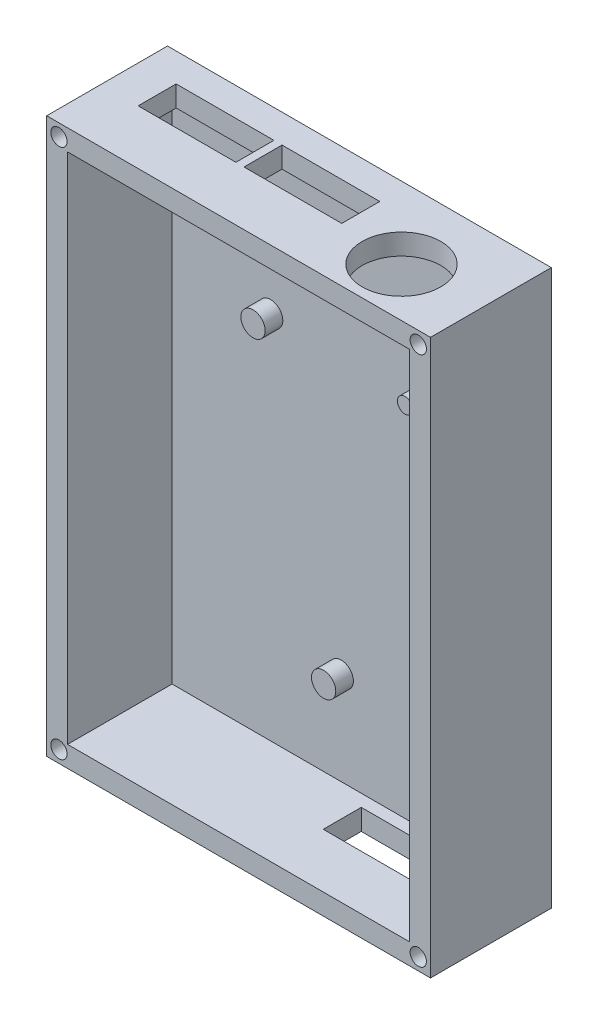
ISO-10303-21;
HEADER;
FILE_DESCRIPTION(('STEP AP214'),'2;1');
FILE_NAME('part.step','',(''),(''),'','','');
FILE_SCHEMA(('AUTOMOTIVE_DESIGN { 1 0 10303 214 1 1 1 1 }'));
ENDSEC;
DATA;
#1=APPLICATION_CONTEXT('core data for automotive mechanical design processes');
#2=APPLICATION_PROTOCOL_DEFINITION('international standard','automotive_design',2000,#1);
#3=PRODUCT_CONTEXT('',#1,'mechanical');
#4=PRODUCT('Part','Part','',(#3));
#5=PRODUCT_RELATED_PRODUCT_CATEGORY('part','',(#4));
#6=PRODUCT_DEFINITION_FORMATION('','',#4);
#7=PRODUCT_DEFINITION_CONTEXT('part definition',#1,'design');
#8=PRODUCT_DEFINITION('design','',#6,#7);
#9=PRODUCT_DEFINITION_SHAPE('','',#8);
#10=(LENGTH_UNIT() NAMED_UNIT(*) SI_UNIT(.MILLI.,.METRE.));
#11=(NAMED_UNIT(*) PLANE_ANGLE_UNIT() SI_UNIT($,.RADIAN.));
#12=(NAMED_UNIT(*) SI_UNIT($,.STERADIAN.) SOLID_ANGLE_UNIT());
#13=UNCERTAINTY_MEASURE_WITH_UNIT(LENGTH_MEASURE(1.E-05),#10,'distance_accuracy_value','');
#14=(GEOMETRIC_REPRESENTATION_CONTEXT(3) GLOBAL_UNCERTAINTY_ASSIGNED_CONTEXT((#13)) GLOBAL_UNIT_ASSIGNED_CONTEXT((#10,
#11,#12)) REPRESENTATION_CONTEXT('',''));
#15=CARTESIAN_POINT('',(0.,0.,0.));
#16=DIRECTION('',(0.,0.,1.));
#17=DIRECTION('',(1.,0.,0.));
#18=AXIS2_PLACEMENT_3D('',#15,#16,#17);
#19=CARTESIAN_POINT('',(0.,0.,0.));
#20=DIRECTION('',(0.,0.,1.));
#21=DIRECTION('',(1.,0.,0.));
#22=AXIS2_PLACEMENT_3D('',#19,#20,#21);
#23=PLANE('',#22);
#24=DIRECTION('',(1.,0.,0.));
#25=VECTOR('',#24,1.);
#26=CARTESIAN_POINT('',(0.,3.84099025766973,0.));
#27=LINE('',#26,#25);
#28=CARTESIAN_POINT('',(3.84099025766973,3.84099025766973,0.));
#29=VERTEX_POINT('',#28);
#30=CARTESIAN_POINT('',(66.8409902576697,3.84099025766973,0.));
#31=VERTEX_POINT('',#30);
#32=EDGE_CURVE('E273',#29,#31,#27,.T.);
#33=ORIENTED_EDGE('',*,*,#32,.T.);
#34=DIRECTION('',(0.,1.,0.));
#35=VECTOR('',#34,1.);
#36=CARTESIAN_POINT('',(66.8409902576697,0.,0.));
#37=LINE('',#36,#35);
#38=CARTESIAN_POINT('',(66.8409902576697,98.3409902576697,0.));
#39=VERTEX_POINT('',#38);
#40=EDGE_CURVE('E317',#31,#39,#37,.T.);
#41=ORIENTED_EDGE('',*,*,#40,.T.);
#42=DIRECTION('',(1.,0.,0.));
#43=VECTOR('',#42,1.);
#44=CARTESIAN_POINT('',(0.,98.3409902576697,0.));
#45=LINE('',#44,#43);
#46=CARTESIAN_POINT('',(3.84099025766974,98.3409902576697,0.));
#47=VERTEX_POINT('',#46);
#48=EDGE_CURVE('E314',#47,#39,#45,.T.);
#49=ORIENTED_EDGE('',*,*,#48,.F.);
#50=DIRECTION('',(0.,1.,0.));
#51=VECTOR('',#50,1.);
#52=CARTESIAN_POINT('',(3.84099025766973,0.,0.));
#53=LINE('',#52,#51);
#54=EDGE_CURVE('E311',#29,#47,#53,.T.);
#55=ORIENTED_EDGE('',*,*,#54,.F.);
#56=EDGE_LOOP('',(#33,#41,#49,#55));
#57=FACE_BOUND('',#56,.T.);
#58=CARTESIAN_POINT('',(50.,73.,0.));
#59=DIRECTION('',(0.,0.,1.));
#60=DIRECTION('',(1.,0.,0.));
#61=AXIS2_PLACEMENT_3D('',#58,#59,#60);
#62=CIRCLE('',#61,1.41421356237309);
#63=CARTESIAN_POINT('',(51.4142135623731,73.,0.));
#64=VERTEX_POINT('',#63);
#65=EDGE_CURVE('E339',#64,#64,#62,.T.);
#66=ORIENTED_EDGE('',*,*,#65,.F.);
#67=EDGE_LOOP('',(#66));
#68=FACE_BOUND('',#67,.T.);
#69=CARTESIAN_POINT('',(22.,72.,0.));
#70=DIRECTION('',(0.,0.,1.));
#71=DIRECTION('',(1.,0.,0.));
#72=AXIS2_PLACEMENT_3D('',#69,#70,#71);
#73=CIRCLE('',#72,2.23606797749979);
#74=CARTESIAN_POINT('',(24.2360679774998,72.,0.));
#75=VERTEX_POINT('',#74);
#76=EDGE_CURVE('E360',#75,#75,#73,.T.);
#77=ORIENTED_EDGE('',*,*,#76,.F.);
#78=EDGE_LOOP('',(#77));
#79=FACE_BOUND('',#78,.T.);
#80=CARTESIAN_POINT('',(35.,21.,0.));
#81=DIRECTION('',(0.,0.,1.));
#82=DIRECTION('',(1.,0.,0.));
#83=AXIS2_PLACEMENT_3D('',#80,#81,#82);
#84=CIRCLE('',#83,2.23606797749979);
#85=CARTESIAN_POINT('',(37.2360679774998,21.,0.));
#86=VERTEX_POINT('',#85);
#87=EDGE_CURVE('E335',#86,#86,#84,.T.);
#88=ORIENTED_EDGE('',*,*,#87,.F.);
#89=EDGE_LOOP('',(#88));
#90=FACE_BOUND('',#89,.T.);
#91=ADVANCED_FACE('F35',(#57,#68,#79,#90),#23,.T.);
#92=CARTESIAN_POINT('',(22.,72.,3.25));
#93=DIRECTION('',(0.,0.,-1.));
#94=DIRECTION('',(-1.,0.,0.));
#95=AXIS2_PLACEMENT_3D('',#92,#93,#94);
#96=CYLINDRICAL_SURFACE('',#95,2.23606797749979);
#97=CARTESIAN_POINT('',(22.,72.,3.25));
#98=DIRECTION('',(0.,0.,1.));
#99=DIRECTION('',(1.,0.,0.));
#100=AXIS2_PLACEMENT_3D('',#97,#98,#99);
#101=CIRCLE('',#100,2.23606797749979);
#102=CARTESIAN_POINT('',(24.2360679774998,72.,3.25));
#103=VERTEX_POINT('',#102);
#104=EDGE_CURVE('E368',#103,#103,#101,.T.);
#105=ORIENTED_EDGE('',*,*,#104,.F.);
#106=EDGE_LOOP('',(#105));
#107=FACE_BOUND('',#106,.T.);
#108=ORIENTED_EDGE('',*,*,#76,.T.);
#109=EDGE_LOOP('',(#108));
#110=FACE_BOUND('',#109,.T.);
#111=ADVANCED_FACE('F37',(#107,#110),#96,.T.);
#112=CARTESIAN_POINT('',(0.,0.,3.25));
#113=DIRECTION('',(0.,0.,1.));
#114=DIRECTION('',(1.,0.,0.));
#115=AXIS2_PLACEMENT_3D('',#112,#113,#114);
#116=PLANE('',#115);
#117=ORIENTED_EDGE('',*,*,#104,.T.);
#118=EDGE_LOOP('',(#117));
#119=FACE_BOUND('',#118,.T.);
#120=ADVANCED_FACE('F398',(#119),#116,.T.);
#121=CARTESIAN_POINT('',(50.,73.,3.25));
#122=DIRECTION('',(0.,0.,-1.));
#123=DIRECTION('',(-1.,0.,0.));
#124=AXIS2_PLACEMENT_3D('',#121,#122,#123);
#125=CYLINDRICAL_SURFACE('',#124,1.41421356237309);
#126=CARTESIAN_POINT('',(50.,73.,3.25));
#127=DIRECTION('',(0.,0.,1.));
#128=DIRECTION('',(1.,0.,0.));
#129=AXIS2_PLACEMENT_3D('',#126,#127,#128);
#130=CIRCLE('',#129,1.41421356237309);
#131=CARTESIAN_POINT('',(51.4142135623731,73.,3.25));
#132=VERTEX_POINT('',#131);
#133=EDGE_CURVE('E342',#132,#132,#130,.T.);
#134=ORIENTED_EDGE('',*,*,#133,.F.);
#135=EDGE_LOOP('',(#134));
#136=FACE_BOUND('',#135,.T.);
#137=ORIENTED_EDGE('',*,*,#65,.T.);
#138=EDGE_LOOP('',(#137));
#139=FACE_BOUND('',#138,.T.);
#140=ADVANCED_FACE('F420',(#136,#139),#125,.T.);
#141=CARTESIAN_POINT('',(0.,0.,3.25));
#142=DIRECTION('',(0.,0.,1.));
#143=DIRECTION('',(1.,0.,0.));
#144=AXIS2_PLACEMENT_3D('',#141,#142,#143);
#145=PLANE('',#144);
#146=ORIENTED_EDGE('',*,*,#133,.T.);
#147=EDGE_LOOP('',(#146));
#148=FACE_BOUND('',#147,.T.);
#149=ADVANCED_FACE('F411',(#148),#145,.T.);
#150=CARTESIAN_POINT('',(35.,21.,3.25));
#151=DIRECTION('',(0.,0.,-1.));
#152=DIRECTION('',(-1.,0.,0.));
#153=AXIS2_PLACEMENT_3D('',#150,#151,#152);
#154=CYLINDRICAL_SURFACE('',#153,2.23606797749979);
#155=CARTESIAN_POINT('',(35.,21.,3.25));
#156=DIRECTION('',(0.,0.,1.));
#157=DIRECTION('',(1.,0.,0.));
#158=AXIS2_PLACEMENT_3D('',#155,#156,#157);
#159=CIRCLE('',#158,2.23606797749979);
#160=CARTESIAN_POINT('',(37.2360679774998,21.,3.25));
#161=VERTEX_POINT('',#160);
#162=EDGE_CURVE('E336',#161,#161,#159,.T.);
#163=ORIENTED_EDGE('',*,*,#162,.F.);
#164=EDGE_LOOP('',(#163));
#165=FACE_BOUND('',#164,.T.);
#166=ORIENTED_EDGE('',*,*,#87,.T.);
#167=EDGE_LOOP('',(#166));
#168=FACE_BOUND('',#167,.T.);
#169=ADVANCED_FACE('F408',(#165,#168),#154,.T.);
#170=CARTESIAN_POINT('',(0.,0.,3.25));
#171=DIRECTION('',(0.,0.,1.));
#172=DIRECTION('',(1.,0.,0.));
#173=AXIS2_PLACEMENT_3D('',#170,#171,#172);
#174=PLANE('',#173);
#175=ORIENTED_EDGE('',*,*,#162,.T.);
#176=EDGE_LOOP('',(#175));
#177=FACE_BOUND('',#176,.T.);
#178=ADVANCED_FACE('F410',(#177),#174,.T.);
#179=CARTESIAN_POINT('',(0.,3.84099025766973,19.25));
#180=DIRECTION('',(0.,1.,0.));
#181=DIRECTION('',(-1.,0.,0.));
#182=AXIS2_PLACEMENT_3D('',#179,#180,#181);
#183=PLANE('',#182);
#184=DIRECTION('',(1.,0.,0.));
#185=VECTOR('',#184,1.);
#186=CARTESIAN_POINT('',(40.9319805153395,3.84099025766973,2.25));
#187=LINE('',#186,#185);
#188=CARTESIAN_POINT('',(40.9319805153395,3.84099025766973,2.25));
#189=VERTEX_POINT('',#188);
#190=CARTESIAN_POINT('',(58.9319805153395,3.84099025766974,2.25));
#191=VERTEX_POINT('',#190);
#192=EDGE_CURVE('E186',#189,#191,#187,.T.);
#193=ORIENTED_EDGE('',*,*,#192,.T.);
#194=DIRECTION('',(0.,0.,1.));
#195=VECTOR('',#194,1.);
#196=CARTESIAN_POINT('',(58.9319805153395,3.84099025766973,2.25));
#197=LINE('',#196,#195);
#198=CARTESIAN_POINT('',(58.9319805153395,3.84099025766973,9.25));
#199=VERTEX_POINT('',#198);
#200=EDGE_CURVE('E173',#191,#199,#197,.T.);
#201=ORIENTED_EDGE('',*,*,#200,.T.);
#202=DIRECTION('',(-1.,0.,0.));
#203=VECTOR('',#202,1.);
#204=CARTESIAN_POINT('',(40.9319805153395,3.84099025766973,9.25));
#205=LINE('',#204,#203);
#206=CARTESIAN_POINT('',(40.9319805153395,3.84099025766973,9.25));
#207=VERTEX_POINT('',#206);
#208=EDGE_CURVE('E204',#199,#207,#205,.T.);
#209=ORIENTED_EDGE('',*,*,#208,.T.);
#210=DIRECTION('',(0.,0.,-1.));
#211=VECTOR('',#210,1.);
#212=CARTESIAN_POINT('',(40.9319805153395,3.84099025766973,2.25));
#213=LINE('',#212,#211);
#214=EDGE_CURVE('E194',#207,#189,#213,.T.);
#215=ORIENTED_EDGE('',*,*,#214,.T.);
#216=EDGE_LOOP('',(#193,#201,#209,#215));
#217=FACE_BOUND('',#216,.T.);
#218=ORIENTED_EDGE('',*,*,#32,.F.);
#219=DIRECTION('',(0.,0.,-1.));
#220=VECTOR('',#219,1.);
#221=CARTESIAN_POINT('',(3.84099025766973,3.84099025766973,19.25));
#222=LINE('',#221,#220);
#223=CARTESIAN_POINT('',(3.84099025766973,3.84099025766973,19.25));
#224=VERTEX_POINT('',#223);
#225=EDGE_CURVE('E332',#224,#29,#222,.T.);
#226=ORIENTED_EDGE('',*,*,#225,.F.);
#227=DIRECTION('',(1.,0.,0.));
#228=VECTOR('',#227,1.);
#229=CARTESIAN_POINT('',(0.,3.84099025766973,19.25));
#230=LINE('',#229,#228);
#231=CARTESIAN_POINT('',(66.8409902576697,3.84099025766973,19.25));
#232=VERTEX_POINT('',#231);
#233=EDGE_CURVE('E274',#224,#232,#230,.T.);
#234=ORIENTED_EDGE('',*,*,#233,.T.);
#235=DIRECTION('',(0.,0.,-1.));
#236=VECTOR('',#235,1.);
#237=CARTESIAN_POINT('',(66.8409902576697,3.84099025766973,19.25));
#238=LINE('',#237,#236);
#239=EDGE_CURVE('E309',#232,#31,#238,.T.);
#240=ORIENTED_EDGE('',*,*,#239,.T.);
#241=EDGE_LOOP('',(#218,#226,#234,#240));
#242=FACE_BOUND('',#241,.T.);
#243=ADVANCED_FACE('F192',(#217,#242),#183,.T.);
#244=CARTESIAN_POINT('',(3.84099025766973,0.,19.25));
#245=DIRECTION('',(-1.,0.,0.));
#246=DIRECTION('',(0.,-1.,0.));
#247=AXIS2_PLACEMENT_3D('',#244,#245,#246);
#248=PLANE('',#247);
#249=ORIENTED_EDGE('',*,*,#54,.T.);
#250=DIRECTION('',(0.,0.,-1.));
#251=VECTOR('',#250,1.);
#252=CARTESIAN_POINT('',(3.84099025766974,98.3409902576697,19.25));
#253=LINE('',#252,#251);
#254=CARTESIAN_POINT('',(3.84099025766974,98.3409902576697,19.25));
#255=VERTEX_POINT('',#254);
#256=EDGE_CURVE('E329',#255,#47,#253,.T.);
#257=ORIENTED_EDGE('',*,*,#256,.F.);
#258=DIRECTION('',(0.,1.,0.));
#259=VECTOR('',#258,1.);
#260=CARTESIAN_POINT('',(3.84099025766973,0.,19.25));
#261=LINE('',#260,#259);
#262=EDGE_CURVE('E277',#224,#255,#261,.T.);
#263=ORIENTED_EDGE('',*,*,#262,.F.);
#264=ORIENTED_EDGE('',*,*,#225,.T.);
#265=EDGE_LOOP('',(#249,#257,#263,#264));
#266=FACE_BOUND('',#265,.T.);
#267=ADVANCED_FACE('F487',(#266),#248,.F.);
#268=CARTESIAN_POINT('',(0.,98.3409902576697,19.25));
#269=DIRECTION('',(0.,1.,0.));
#270=DIRECTION('',(-1.,0.,0.));
#271=AXIS2_PLACEMENT_3D('',#268,#269,#270);
#272=PLANE('',#271);
#273=DIRECTION('',(1.,0.,0.));
#274=VECTOR('',#273,1.);
#275=CARTESIAN_POINT('',(26.3409902576697,98.3409902576697,2.25));
#276=LINE('',#275,#274);
#277=CARTESIAN_POINT('',(26.3409902576697,98.3409902576697,2.25));
#278=VERTEX_POINT('',#277);
#279=CARTESIAN_POINT('',(44.3409902576697,98.3409902576697,2.25));
#280=VERTEX_POINT('',#279);
#281=EDGE_CURVE('E220',#278,#280,#276,.T.);
#282=ORIENTED_EDGE('',*,*,#281,.F.);
#283=DIRECTION('',(0.,0.,-1.));
#284=VECTOR('',#283,1.);
#285=CARTESIAN_POINT('',(26.3409902576697,98.3409902576697,2.25));
#286=LINE('',#285,#284);
#287=CARTESIAN_POINT('',(26.3409902576697,98.3409902576697,9.25));
#288=VERTEX_POINT('',#287);
#289=EDGE_CURVE('E209',#288,#278,#286,.T.);
#290=ORIENTED_EDGE('',*,*,#289,.F.);
#291=DIRECTION('',(-1.,0.,0.));
#292=VECTOR('',#291,1.);
#293=CARTESIAN_POINT('',(26.3409902576697,98.3409902576697,9.25));
#294=LINE('',#293,#292);
#295=CARTESIAN_POINT('',(44.3409902576697,98.3409902576697,9.25));
#296=VERTEX_POINT('',#295);
#297=EDGE_CURVE('E226',#296,#288,#294,.T.);
#298=ORIENTED_EDGE('',*,*,#297,.F.);
#299=DIRECTION('',(0.,0.,1.));
#300=VECTOR('',#299,1.);
#301=CARTESIAN_POINT('',(44.3409902576697,98.3409902576697,2.25));
#302=LINE('',#301,#300);
#303=EDGE_CURVE('E223',#280,#296,#302,.T.);
#304=ORIENTED_EDGE('',*,*,#303,.F.);
#305=EDGE_LOOP('',(#282,#290,#298,#304));
#306=FACE_BOUND('',#305,.T.);
#307=DIRECTION('',(1.,0.,0.));
#308=VECTOR('',#307,1.);
#309=CARTESIAN_POINT('',(6.84099025766974,98.3409902576697,2.25));
#310=LINE('',#309,#308);
#311=CARTESIAN_POINT('',(6.84099025766974,98.3409902576697,2.25));
#312=VERTEX_POINT('',#311);
#313=CARTESIAN_POINT('',(24.8409902576697,98.3409902576697,2.25));
#314=VERTEX_POINT('',#313);
#315=EDGE_CURVE('E249',#312,#314,#310,.T.);
#316=ORIENTED_EDGE('',*,*,#315,.F.);
#317=DIRECTION('',(0.,0.,-1.));
#318=VECTOR('',#317,1.);
#319=CARTESIAN_POINT('',(6.84099025766974,98.3409902576697,2.25));
#320=LINE('',#319,#318);
#321=CARTESIAN_POINT('',(6.84099025766974,98.3409902576697,9.25));
#322=VERTEX_POINT('',#321);
#323=EDGE_CURVE('E238',#322,#312,#320,.T.);
#324=ORIENTED_EDGE('',*,*,#323,.F.);
#325=DIRECTION('',(-1.,0.,0.));
#326=VECTOR('',#325,1.);
#327=CARTESIAN_POINT('',(6.84099025766974,98.3409902576697,9.25));
#328=LINE('',#327,#326);
#329=CARTESIAN_POINT('',(24.8409902576697,98.3409902576697,9.25));
#330=VERTEX_POINT('',#329);
#331=EDGE_CURVE('E255',#330,#322,#328,.T.);
#332=ORIENTED_EDGE('',*,*,#331,.F.);
#333=DIRECTION('',(0.,0.,1.));
#334=VECTOR('',#333,1.);
#335=CARTESIAN_POINT('',(24.8409902576697,98.3409902576697,2.25));
#336=LINE('',#335,#334);
#337=EDGE_CURVE('E252',#314,#330,#336,.T.);
#338=ORIENTED_EDGE('',*,*,#337,.F.);
#339=EDGE_LOOP('',(#316,#324,#332,#338));
#340=FACE_BOUND('',#339,.T.);
#341=CARTESIAN_POINT('',(56.3409902576698,98.3409902576697,10.25));
#342=DIRECTION('',(0.,-1.,0.));
#343=DIRECTION('',(0.,0.,-1.));
#344=AXIS2_PLACEMENT_3D('',#341,#342,#343);
#345=CIRCLE('',#344,7.25);
#346=CARTESIAN_POINT('',(56.3409902576698,98.3409902576697,3.));
#347=VERTEX_POINT('',#346);
#348=EDGE_CURVE('E267',#347,#347,#345,.T.);
#349=ORIENTED_EDGE('',*,*,#348,.F.);
#350=EDGE_LOOP('',(#349));
#351=FACE_BOUND('',#350,.T.);
#352=ORIENTED_EDGE('',*,*,#48,.T.);
#353=DIRECTION('',(0.,0.,-1.));
#354=VECTOR('',#353,1.);
#355=CARTESIAN_POINT('',(66.8409902576697,98.3409902576697,19.25));
#356=LINE('',#355,#354);
#357=CARTESIAN_POINT('',(66.8409902576697,98.3409902576697,19.25));
#358=VERTEX_POINT('',#357);
#359=EDGE_CURVE('E326',#358,#39,#356,.T.);
#360=ORIENTED_EDGE('',*,*,#359,.F.);
#361=DIRECTION('',(1.,0.,0.));
#362=VECTOR('',#361,1.);
#363=CARTESIAN_POINT('',(0.,98.3409902576697,19.25));
#364=LINE('',#363,#362);
#365=EDGE_CURVE('E280',#255,#358,#364,.T.);
#366=ORIENTED_EDGE('',*,*,#365,.F.);
#367=ORIENTED_EDGE('',*,*,#256,.T.);
#368=EDGE_LOOP('',(#352,#360,#366,#367));
#369=FACE_BOUND('',#368,.T.);
#370=ADVANCED_FACE('F477',(#306,#340,#351,#369),#272,.F.);
#371=CARTESIAN_POINT('',(2.25,2.25,19.25));
#372=DIRECTION('',(0.,0.,-1.));
#373=DIRECTION('',(-1.,0.,0.));
#374=AXIS2_PLACEMENT_3D('',#371,#372,#373);
#375=CYLINDRICAL_SURFACE('',#374,1.5);
#376=CARTESIAN_POINT('',(2.25,2.25,19.25));
#377=DIRECTION('',(0.,0.,1.));
#378=DIRECTION('',(1.,0.,0.));
#379=AXIS2_PLACEMENT_3D('',#376,#377,#378);
#380=CIRCLE('',#379,1.5);
#381=CARTESIAN_POINT('',(3.75,2.25,19.25));
#382=VERTEX_POINT('',#381);
#383=EDGE_CURVE('E291',#382,#382,#380,.T.);
#384=ORIENTED_EDGE('',*,*,#383,.T.);
#385=EDGE_LOOP('',(#384));
#386=FACE_BOUND('',#385,.T.);
#387=CARTESIAN_POINT('',(2.25,2.25,0.));
#388=DIRECTION('',(0.,0.,1.));
#389=DIRECTION('',(1.,0.,0.));
#390=AXIS2_PLACEMENT_3D('',#387,#388,#389);
#391=CIRCLE('',#390,1.5);
#392=CARTESIAN_POINT('',(3.75,2.25,0.));
#393=VERTEX_POINT('',#392);
#394=EDGE_CURVE('E11',#393,#393,#391,.F.);
#395=ORIENTED_EDGE('',*,*,#394,.T.);
#396=EDGE_LOOP('',(#395));
#397=FACE_BOUND('',#396,.T.);
#398=ADVANCED_FACE('F473',(#386,#397),#375,.F.);
#399=CARTESIAN_POINT('',(68.4319805153395,2.25,19.25));
#400=DIRECTION('',(0.,0.,-1.));
#401=DIRECTION('',(-1.,0.,0.));
#402=AXIS2_PLACEMENT_3D('',#399,#400,#401);
#403=CYLINDRICAL_SURFACE('',#402,1.5);
#404=CARTESIAN_POINT('',(68.4319805153395,2.25,19.25));
#405=DIRECTION('',(0.,0.,1.));
#406=DIRECTION('',(1.,0.,0.));
#407=AXIS2_PLACEMENT_3D('',#404,#405,#406);
#408=CIRCLE('',#407,1.5);
#409=CARTESIAN_POINT('',(69.9319805153395,2.25,19.25));
#410=VERTEX_POINT('',#409);
#411=EDGE_CURVE('E288',#410,#410,#408,.F.);
#412=ORIENTED_EDGE('',*,*,#411,.F.);
#413=EDGE_LOOP('',(#412));
#414=FACE_BOUND('',#413,.T.);
#415=CARTESIAN_POINT('',(68.4319805153395,2.25,0.));
#416=DIRECTION('',(0.,0.,1.));
#417=DIRECTION('',(1.,0.,0.));
#418=AXIS2_PLACEMENT_3D('',#415,#416,#417);
#419=CIRCLE('',#418,1.5);
#420=CARTESIAN_POINT('',(69.9319805153395,2.25,0.));
#421=VERTEX_POINT('',#420);
#422=EDGE_CURVE('E319',#421,#421,#419,.F.);
#423=ORIENTED_EDGE('',*,*,#422,.T.);
#424=EDGE_LOOP('',(#423));
#425=FACE_BOUND('',#424,.T.);
#426=ADVANCED_FACE('F476',(#414,#425),#403,.F.);
#427=CARTESIAN_POINT('',(68.4319805153395,99.9319805153395,19.25));
#428=DIRECTION('',(0.,0.,-1.));
#429=DIRECTION('',(-1.,0.,0.));
#430=AXIS2_PLACEMENT_3D('',#427,#428,#429);
#431=CYLINDRICAL_SURFACE('',#430,1.5);
#432=CARTESIAN_POINT('',(68.4319805153395,99.9319805153395,19.25));
#433=DIRECTION('',(0.,0.,1.));
#434=DIRECTION('',(1.,0.,0.));
#435=AXIS2_PLACEMENT_3D('',#432,#433,#434);
#436=CIRCLE('',#435,1.5);
#437=CARTESIAN_POINT('',(69.9319805153395,99.9319805153395,19.25));
#438=VERTEX_POINT('',#437);
#439=EDGE_CURVE('E285',#438,#438,#436,.T.);
#440=ORIENTED_EDGE('',*,*,#439,.T.);
#441=EDGE_LOOP('',(#440));
#442=FACE_BOUND('',#441,.T.);
#443=CARTESIAN_POINT('',(68.4319805153395,99.9319805153395,0.));
#444=DIRECTION('',(0.,0.,1.));
#445=DIRECTION('',(1.,0.,0.));
#446=AXIS2_PLACEMENT_3D('',#443,#444,#445);
#447=CIRCLE('',#446,1.5);
#448=CARTESIAN_POINT('',(69.9319805153395,99.9319805153395,0.));
#449=VERTEX_POINT('',#448);
#450=EDGE_CURVE('E43',#449,#449,#447,.F.);
#451=ORIENTED_EDGE('',*,*,#450,.T.);
#452=EDGE_LOOP('',(#451));
#453=FACE_BOUND('',#452,.T.);
#454=ADVANCED_FACE('F373',(#442,#453),#431,.F.);
#455=CARTESIAN_POINT('',(66.8409902576697,0.,19.25));
#456=DIRECTION('',(-1.,0.,0.));
#457=DIRECTION('',(0.,-1.,0.));
#458=AXIS2_PLACEMENT_3D('',#455,#456,#457);
#459=PLANE('',#458);
#460=ORIENTED_EDGE('',*,*,#40,.F.);
#461=ORIENTED_EDGE('',*,*,#239,.F.);
#462=DIRECTION('',(0.,1.,0.));
#463=VECTOR('',#462,1.);
#464=CARTESIAN_POINT('',(66.8409902576697,0.,19.25));
#465=LINE('',#464,#463);
#466=EDGE_CURVE('E282',#232,#358,#465,.T.);
#467=ORIENTED_EDGE('',*,*,#466,.T.);
#468=ORIENTED_EDGE('',*,*,#359,.T.);
#469=EDGE_LOOP('',(#460,#461,#467,#468));
#470=FACE_BOUND('',#469,.T.);
#471=ADVANCED_FACE('F463',(#470),#459,.T.);
#472=CARTESIAN_POINT('',(2.25,99.9319805153395,19.25));
#473=DIRECTION('',(0.,0.,-1.));
#474=DIRECTION('',(-1.,0.,0.));
#475=AXIS2_PLACEMENT_3D('',#472,#473,#474);
#476=CYLINDRICAL_SURFACE('',#475,1.5);
#477=CARTESIAN_POINT('',(2.25,99.9319805153395,19.25));
#478=DIRECTION('',(0.,0.,1.));
#479=DIRECTION('',(1.,0.,0.));
#480=AXIS2_PLACEMENT_3D('',#477,#478,#479);
#481=CIRCLE('',#480,1.5);
#482=CARTESIAN_POINT('',(3.75,99.9319805153395,19.25));
#483=VERTEX_POINT('',#482);
#484=EDGE_CURVE('E306',#483,#483,#481,.F.);
#485=ORIENTED_EDGE('',*,*,#484,.F.);
#486=EDGE_LOOP('',(#485));
#487=FACE_BOUND('',#486,.T.);
#488=CARTESIAN_POINT('',(2.25,99.9319805153395,0.));
#489=DIRECTION('',(0.,0.,1.));
#490=DIRECTION('',(1.,0.,0.));
#491=AXIS2_PLACEMENT_3D('',#488,#489,#490);
#492=CIRCLE('',#491,1.5);
#493=CARTESIAN_POINT('',(3.75,99.9319805153395,0.));
#494=VERTEX_POINT('',#493);
#495=EDGE_CURVE('E278',#494,#494,#492,.F.);
#496=ORIENTED_EDGE('',*,*,#495,.T.);
#497=EDGE_LOOP('',(#496));
#498=FACE_BOUND('',#497,.T.);
#499=ADVANCED_FACE('F440',(#487,#498),#476,.F.);
#500=CARTESIAN_POINT('',(0.,0.,19.25));
#501=DIRECTION('',(0.,0.,1.));
#502=DIRECTION('',(1.,0.,0.));
#503=AXIS2_PLACEMENT_3D('',#500,#501,#502);
#504=PLANE('',#503);
#505=ORIENTED_EDGE('',*,*,#233,.F.);
#506=ORIENTED_EDGE('',*,*,#262,.T.);
#507=ORIENTED_EDGE('',*,*,#365,.T.);
#508=ORIENTED_EDGE('',*,*,#466,.F.);
#509=EDGE_LOOP('',(#505,#506,#507,#508));
#510=FACE_BOUND('',#509,.T.);
#511=ORIENTED_EDGE('',*,*,#439,.F.);
#512=EDGE_LOOP('',(#511));
#513=FACE_BOUND('',#512,.T.);
#514=ORIENTED_EDGE('',*,*,#411,.T.);
#515=EDGE_LOOP('',(#514));
#516=FACE_BOUND('',#515,.T.);
#517=ORIENTED_EDGE('',*,*,#383,.F.);
#518=EDGE_LOOP('',(#517));
#519=FACE_BOUND('',#518,.T.);
#520=DIRECTION('',(1.,0.,0.));
#521=VECTOR('',#520,1.);
#522=CARTESIAN_POINT('',(0.,0.,19.25));
#523=LINE('',#522,#521);
#524=CARTESIAN_POINT('',(0.,0.,19.25));
#525=VERTEX_POINT('',#524);
#526=CARTESIAN_POINT('',(70.6819805153395,0.,19.25));
#527=VERTEX_POINT('',#526);
#528=EDGE_CURVE('E294',#525,#527,#523,.T.);
#529=ORIENTED_EDGE('',*,*,#528,.T.);
#530=DIRECTION('',(0.,1.,0.));
#531=VECTOR('',#530,1.);
#532=CARTESIAN_POINT('',(70.6819805153395,0.,19.25));
#533=LINE('',#532,#531);
#534=CARTESIAN_POINT('',(70.6819805153395,102.181980515339,19.25));
#535=VERTEX_POINT('',#534);
#536=EDGE_CURVE('E297',#527,#535,#533,.T.);
#537=ORIENTED_EDGE('',*,*,#536,.T.);
#538=DIRECTION('',(1.,0.,0.));
#539=VECTOR('',#538,1.);
#540=CARTESIAN_POINT('',(0.,102.181980515339,19.25));
#541=LINE('',#540,#539);
#542=CARTESIAN_POINT('',(0.,102.181980515339,19.25));
#543=VERTEX_POINT('',#542);
#544=EDGE_CURVE('E300',#543,#535,#541,.T.);
#545=ORIENTED_EDGE('',*,*,#544,.F.);
#546=DIRECTION('',(0.,1.,0.));
#547=VECTOR('',#546,1.);
#548=CARTESIAN_POINT('',(0.,0.,19.25));
#549=LINE('',#548,#547);
#550=EDGE_CURVE('E303',#525,#543,#549,.T.);
#551=ORIENTED_EDGE('',*,*,#550,.F.);
#552=EDGE_LOOP('',(#529,#537,#545,#551));
#553=FACE_BOUND('',#552,.T.);
#554=ORIENTED_EDGE('',*,*,#484,.T.);
#555=EDGE_LOOP('',(#554));
#556=FACE_BOUND('',#555,.T.);
#557=ADVANCED_FACE('F431',(#510,#513,#516,#519,#553,#556),#504,.T.);
#558=CARTESIAN_POINT('',(0.,0.,-3.));
#559=DIRECTION('',(0.,0.,1.));
#560=DIRECTION('',(1.,0.,0.));
#561=AXIS2_PLACEMENT_3D('',#558,#559,#560);
#562=PLANE('',#561);
#563=DIRECTION('',(1.,0.,0.));
#564=VECTOR('',#563,1.);
#565=CARTESIAN_POINT('',(0.,0.,-3.));
#566=LINE('',#565,#564);
#567=CARTESIAN_POINT('',(0.,0.,-3.));
#568=VERTEX_POINT('',#567);
#569=CARTESIAN_POINT('',(70.6819805153395,0.,-3.));
#570=VERTEX_POINT('',#569);
#571=EDGE_CURVE('E345',#568,#570,#566,.T.);
#572=ORIENTED_EDGE('',*,*,#571,.F.);
#573=DIRECTION('',(0.,1.,0.));
#574=VECTOR('',#573,1.);
#575=CARTESIAN_POINT('',(0.,0.,-3.));
#576=LINE('',#575,#574);
#577=CARTESIAN_POINT('',(0.,102.181980515339,-3.));
#578=VERTEX_POINT('',#577);
#579=EDGE_CURVE('E355',#568,#578,#576,.T.);
#580=ORIENTED_EDGE('',*,*,#579,.T.);
#581=DIRECTION('',(1.,0.,0.));
#582=VECTOR('',#581,1.);
#583=CARTESIAN_POINT('',(0.,102.181980515339,-3.));
#584=LINE('',#583,#582);
#585=CARTESIAN_POINT('',(70.6819805153395,102.181980515339,-3.));
#586=VERTEX_POINT('',#585);
#587=EDGE_CURVE('E353',#578,#586,#584,.T.);
#588=ORIENTED_EDGE('',*,*,#587,.T.);
#589=DIRECTION('',(0.,1.,0.));
#590=VECTOR('',#589,1.);
#591=CARTESIAN_POINT('',(70.6819805153395,0.,-3.));
#592=LINE('',#591,#590);
#593=EDGE_CURVE('E350',#570,#586,#592,.T.);
#594=ORIENTED_EDGE('',*,*,#593,.F.);
#595=EDGE_LOOP('',(#572,#580,#588,#594));
#596=FACE_BOUND('',#595,.T.);
#597=ADVANCED_FACE('F428',(#596),#562,.F.);
#598=CARTESIAN_POINT('',(70.6819805153395,0.,-3.));
#599=DIRECTION('',(1.,0.,0.));
#600=DIRECTION('',(0.,1.,0.));
#601=AXIS2_PLACEMENT_3D('',#598,#599,#600);
#602=PLANE('',#601);
#603=DIRECTION('',(0.,0.,1.));
#604=VECTOR('',#603,1.);
#605=CARTESIAN_POINT('',(70.6819805153395,102.181980515339,-3.));
#606=LINE('',#605,#604);
#607=EDGE_CURVE('E363',#586,#535,#606,.T.);
#608=ORIENTED_EDGE('',*,*,#607,.T.);
#609=ORIENTED_EDGE('',*,*,#536,.F.);
#610=DIRECTION('',(0.,0.,1.));
#611=VECTOR('',#610,1.);
#612=CARTESIAN_POINT('',(70.6819805153395,0.,-3.));
#613=LINE('',#612,#611);
#614=EDGE_CURVE('E357',#570,#527,#613,.T.);
#615=ORIENTED_EDGE('',*,*,#614,.F.);
#616=ORIENTED_EDGE('',*,*,#593,.T.);
#617=EDGE_LOOP('',(#608,#609,#615,#616));
#618=FACE_BOUND('',#617,.T.);
#619=ADVANCED_FACE('F430',(#618),#602,.T.);
#620=CARTESIAN_POINT('',(0.,102.181980515339,-3.));
#621=DIRECTION('',(0.,-1.,0.));
#622=DIRECTION('',(1.,0.,0.));
#623=AXIS2_PLACEMENT_3D('',#620,#621,#622);
#624=PLANE('',#623);
#625=DIRECTION('',(1.,0.,0.));
#626=VECTOR('',#625,1.);
#627=CARTESIAN_POINT('',(26.3409902576697,102.181980515339,9.25));
#628=LINE('',#627,#626);
#629=CARTESIAN_POINT('',(26.3409902576697,102.181980515339,9.25));
#630=VERTEX_POINT('',#629);
#631=CARTESIAN_POINT('',(44.3409902576697,102.181980515339,9.25));
#632=VERTEX_POINT('',#631);
#633=EDGE_CURVE('E213',#630,#632,#628,.T.);
#634=ORIENTED_EDGE('',*,*,#633,.F.);
#635=DIRECTION('',(0.,0.,1.));
#636=VECTOR('',#635,1.);
#637=CARTESIAN_POINT('',(26.3409902576697,102.181980515339,2.25));
#638=LINE('',#637,#636);
#639=CARTESIAN_POINT('',(26.3409902576697,102.181980515339,2.25));
#640=VERTEX_POINT('',#639);
#641=EDGE_CURVE('E216',#640,#630,#638,.T.);
#642=ORIENTED_EDGE('',*,*,#641,.F.);
#643=DIRECTION('',(-1.,0.,0.));
#644=VECTOR('',#643,1.);
#645=CARTESIAN_POINT('',(26.3409902576697,102.181980515339,2.25));
#646=LINE('',#645,#644);
#647=CARTESIAN_POINT('',(44.3409902576697,102.181980515339,2.25));
#648=VERTEX_POINT('',#647);
#649=EDGE_CURVE('E218',#648,#640,#646,.T.);
#650=ORIENTED_EDGE('',*,*,#649,.F.);
#651=DIRECTION('',(0.,0.,-1.));
#652=VECTOR('',#651,1.);
#653=CARTESIAN_POINT('',(44.3409902576697,102.181980515339,2.25));
#654=LINE('',#653,#652);
#655=EDGE_CURVE('E210',#632,#648,#654,.T.);
#656=ORIENTED_EDGE('',*,*,#655,.F.);
#657=EDGE_LOOP('',(#634,#642,#650,#656));
#658=FACE_BOUND('',#657,.T.);
#659=DIRECTION('',(1.,0.,0.));
#660=VECTOR('',#659,1.);
#661=CARTESIAN_POINT('',(6.84099025766975,102.181980515339,9.25));
#662=LINE('',#661,#660);
#663=CARTESIAN_POINT('',(6.84099025766974,102.181980515339,9.25));
#664=VERTEX_POINT('',#663);
#665=CARTESIAN_POINT('',(24.8409902576697,102.181980515339,9.25));
#666=VERTEX_POINT('',#665);
#667=EDGE_CURVE('E242',#664,#666,#662,.T.);
#668=ORIENTED_EDGE('',*,*,#667,.F.);
#669=DIRECTION('',(0.,0.,1.));
#670=VECTOR('',#669,1.);
#671=CARTESIAN_POINT('',(6.84099025766974,102.181980515339,2.25));
#672=LINE('',#671,#670);
#673=CARTESIAN_POINT('',(6.84099025766974,102.181980515339,2.25));
#674=VERTEX_POINT('',#673);
#675=EDGE_CURVE('E245',#674,#664,#672,.T.);
#676=ORIENTED_EDGE('',*,*,#675,.F.);
#677=DIRECTION('',(-1.,0.,0.));
#678=VECTOR('',#677,1.);
#679=CARTESIAN_POINT('',(6.84099025766975,102.181980515339,2.25));
#680=LINE('',#679,#678);
#681=CARTESIAN_POINT('',(24.8409902576697,102.181980515339,2.25));
#682=VERTEX_POINT('',#681);
#683=EDGE_CURVE('E247',#682,#674,#680,.T.);
#684=ORIENTED_EDGE('',*,*,#683,.F.);
#685=DIRECTION('',(0.,0.,-1.));
#686=VECTOR('',#685,1.);
#687=CARTESIAN_POINT('',(24.8409902576697,102.181980515339,2.25));
#688=LINE('',#687,#686);
#689=EDGE_CURVE('E239',#666,#682,#688,.T.);
#690=ORIENTED_EDGE('',*,*,#689,.F.);
#691=EDGE_LOOP('',(#668,#676,#684,#690));
#692=FACE_BOUND('',#691,.T.);
#693=CARTESIAN_POINT('',(56.3409902576698,102.181980515339,10.25));
#694=DIRECTION('',(0.,-1.,0.));
#695=DIRECTION('',(1.,0.,0.));
#696=AXIS2_PLACEMENT_3D('',#693,#694,#695);
#697=CIRCLE('',#696,7.25);
#698=CARTESIAN_POINT('',(63.5909902576698,102.181980515339,10.25));
#699=VERTEX_POINT('',#698);
#700=EDGE_CURVE('E270',#699,#699,#697,.F.);
#701=ORIENTED_EDGE('',*,*,#700,.F.);
#702=EDGE_LOOP('',(#701));
#703=FACE_BOUND('',#702,.T.);
#704=DIRECTION('',(0.,0.,1.));
#705=VECTOR('',#704,1.);
#706=CARTESIAN_POINT('',(0.,102.181980515339,-3.));
#707=LINE('',#706,#705);
#708=EDGE_CURVE('E361',#578,#543,#707,.T.);
#709=ORIENTED_EDGE('',*,*,#708,.T.);
#710=ORIENTED_EDGE('',*,*,#544,.T.);
#711=ORIENTED_EDGE('',*,*,#607,.F.);
#712=ORIENTED_EDGE('',*,*,#587,.F.);
#713=EDGE_LOOP('',(#709,#710,#711,#712));
#714=FACE_BOUND('',#713,.T.);
#715=ADVANCED_FACE('F437',(#658,#692,#703,#714),#624,.F.);
#716=CARTESIAN_POINT('',(0.,0.,-3.));
#717=DIRECTION('',(1.,0.,0.));
#718=DIRECTION('',(0.,1.,0.));
#719=AXIS2_PLACEMENT_3D('',#716,#717,#718);
#720=PLANE('',#719);
#721=DIRECTION('',(0.,0.,1.));
#722=VECTOR('',#721,1.);
#723=CARTESIAN_POINT('',(0.,0.,-3.));
#724=LINE('',#723,#722);
#725=EDGE_CURVE('E358',#568,#525,#724,.T.);
#726=ORIENTED_EDGE('',*,*,#725,.T.);
#727=ORIENTED_EDGE('',*,*,#550,.T.);
#728=ORIENTED_EDGE('',*,*,#708,.F.);
#729=ORIENTED_EDGE('',*,*,#579,.F.);
#730=EDGE_LOOP('',(#726,#727,#728,#729));
#731=FACE_BOUND('',#730,.T.);
#732=ADVANCED_FACE('F452',(#731),#720,.F.);
#733=CARTESIAN_POINT('',(0.,0.,-3.));
#734=DIRECTION('',(0.,-1.,0.));
#735=DIRECTION('',(1.,0.,0.));
#736=AXIS2_PLACEMENT_3D('',#733,#734,#735);
#737=PLANE('',#736);
#738=DIRECTION('',(1.,0.,0.));
#739=VECTOR('',#738,1.);
#740=CARTESIAN_POINT('',(40.9319805153395,0.,2.25));
#741=LINE('',#740,#739);
#742=CARTESIAN_POINT('',(40.9319805153395,0.,2.25));
#743=VERTEX_POINT('',#742);
#744=CARTESIAN_POINT('',(58.9319805153395,0.,2.25));
#745=VERTEX_POINT('',#744);
#746=EDGE_CURVE('E189',#743,#745,#741,.T.);
#747=ORIENTED_EDGE('',*,*,#746,.F.);
#748=DIRECTION('',(0.,0.,-1.));
#749=VECTOR('',#748,1.);
#750=CARTESIAN_POINT('',(40.9319805153395,0.,2.25));
#751=LINE('',#750,#749);
#752=CARTESIAN_POINT('',(40.9319805153395,0.,9.25));
#753=VERTEX_POINT('',#752);
#754=EDGE_CURVE('E200',#753,#743,#751,.T.);
#755=ORIENTED_EDGE('',*,*,#754,.F.);
#756=DIRECTION('',(-1.,0.,0.));
#757=VECTOR('',#756,1.);
#758=CARTESIAN_POINT('',(40.9319805153395,0.,9.25));
#759=LINE('',#758,#757);
#760=CARTESIAN_POINT('',(58.9319805153395,0.,9.25));
#761=VERTEX_POINT('',#760);
#762=EDGE_CURVE('E58',#761,#753,#759,.T.);
#763=ORIENTED_EDGE('',*,*,#762,.F.);
#764=DIRECTION('',(0.,0.,1.));
#765=VECTOR('',#764,1.);
#766=CARTESIAN_POINT('',(58.9319805153395,0.,2.25));
#767=LINE('',#766,#765);
#768=EDGE_CURVE('E196',#745,#761,#767,.T.);
#769=ORIENTED_EDGE('',*,*,#768,.F.);
#770=EDGE_LOOP('',(#747,#755,#763,#769));
#771=FACE_BOUND('',#770,.T.);
#772=ORIENTED_EDGE('',*,*,#614,.T.);
#773=ORIENTED_EDGE('',*,*,#528,.F.);
#774=ORIENTED_EDGE('',*,*,#725,.F.);
#775=ORIENTED_EDGE('',*,*,#571,.T.);
#776=EDGE_LOOP('',(#772,#773,#774,#775));
#777=FACE_BOUND('',#776,.T.);
#778=ADVANCED_FACE('F386',(#771,#777),#737,.T.);
#779=ORIENTED_EDGE('',*,*,#495,.F.);
#780=EDGE_LOOP('',(#779));
#781=FACE_BOUND('',#780,.T.);
#782=ADVANCED_FACE('F378',(#781),#23,.T.);
#783=ORIENTED_EDGE('',*,*,#450,.F.);
#784=EDGE_LOOP('',(#783));
#785=FACE_BOUND('',#784,.T.);
#786=ADVANCED_FACE('F375',(#785),#23,.T.);
#787=ORIENTED_EDGE('',*,*,#422,.F.);
#788=EDGE_LOOP('',(#787));
#789=FACE_BOUND('',#788,.T.);
#790=ADVANCED_FACE('F377',(#789),#23,.T.);
#791=ORIENTED_EDGE('',*,*,#394,.F.);
#792=EDGE_LOOP('',(#791));
#793=FACE_BOUND('',#792,.T.);
#794=ADVANCED_FACE('F380',(#793),#23,.T.);
#795=CARTESIAN_POINT('',(56.3409902576698,122.688077169749,10.25));
#796=DIRECTION('',(0.,-1.,0.));
#797=DIRECTION('',(0.,0.,-1.));
#798=AXIS2_PLACEMENT_3D('',#795,#796,#797);
#799=CYLINDRICAL_SURFACE('',#798,7.25);
#800=ORIENTED_EDGE('',*,*,#700,.T.);
#801=EDGE_LOOP('',(#800));
#802=FACE_BOUND('',#801,.T.);
#803=ORIENTED_EDGE('',*,*,#348,.T.);
#804=EDGE_LOOP('',(#803));
#805=FACE_BOUND('',#804,.T.);
#806=ADVANCED_FACE('F391',(#802,#805),#799,.F.);
#807=CARTESIAN_POINT('',(6.84099025766974,122.688077169749,2.25));
#808=DIRECTION('',(-1.,0.,0.));
#809=DIRECTION('',(0.,0.,1.));
#810=AXIS2_PLACEMENT_3D('',#807,#808,#809);
#811=PLANE('',#810);
#812=ORIENTED_EDGE('',*,*,#675,.T.);
#813=DIRECTION('',(0.,-1.,0.));
#814=VECTOR('',#813,1.);
#815=CARTESIAN_POINT('',(6.84099025766974,122.688077169749,9.25));
#816=LINE('',#815,#814);
#817=EDGE_CURVE('E243',#664,#322,#816,.T.);
#818=ORIENTED_EDGE('',*,*,#817,.T.);
#819=ORIENTED_EDGE('',*,*,#323,.T.);
#820=DIRECTION('',(0.,-1.,0.));
#821=VECTOR('',#820,1.);
#822=CARTESIAN_POINT('',(6.84099025766974,122.688077169749,2.25));
#823=LINE('',#822,#821);
#824=EDGE_CURVE('E258',#674,#312,#823,.T.);
#825=ORIENTED_EDGE('',*,*,#824,.F.);
#826=EDGE_LOOP('',(#812,#818,#819,#825));
#827=FACE_BOUND('',#826,.T.);
#828=ADVANCED_FACE('F583',(#827),#811,.F.);
#829=CARTESIAN_POINT('',(6.84099025766974,122.688077169749,9.25));
#830=DIRECTION('',(0.,0.,1.));
#831=DIRECTION('',(1.,0.,0.));
#832=AXIS2_PLACEMENT_3D('',#829,#830,#831);
#833=PLANE('',#832);
#834=ORIENTED_EDGE('',*,*,#667,.T.);
#835=DIRECTION('',(0.,-1.,0.));
#836=VECTOR('',#835,1.);
#837=CARTESIAN_POINT('',(24.8409902576697,122.688077169749,9.25));
#838=LINE('',#837,#836);
#839=EDGE_CURVE('E260',#666,#330,#838,.T.);
#840=ORIENTED_EDGE('',*,*,#839,.T.);
#841=ORIENTED_EDGE('',*,*,#331,.T.);
#842=ORIENTED_EDGE('',*,*,#817,.F.);
#843=EDGE_LOOP('',(#834,#840,#841,#842));
#844=FACE_BOUND('',#843,.T.);
#845=ADVANCED_FACE('F590',(#844),#833,.F.);
#846=CARTESIAN_POINT('',(24.8409902576697,122.688077169749,2.25));
#847=DIRECTION('',(1.,0.,0.));
#848=DIRECTION('',(0.,0.,-1.));
#849=AXIS2_PLACEMENT_3D('',#846,#847,#848);
#850=PLANE('',#849);
#851=ORIENTED_EDGE('',*,*,#689,.T.);
#852=DIRECTION('',(0.,-1.,0.));
#853=VECTOR('',#852,1.);
#854=CARTESIAN_POINT('',(24.8409902576697,122.688077169749,2.25));
#855=LINE('',#854,#853);
#856=EDGE_CURVE('E262',#682,#314,#855,.T.);
#857=ORIENTED_EDGE('',*,*,#856,.T.);
#858=ORIENTED_EDGE('',*,*,#337,.T.);
#859=ORIENTED_EDGE('',*,*,#839,.F.);
#860=EDGE_LOOP('',(#851,#857,#858,#859));
#861=FACE_BOUND('',#860,.T.);
#862=ADVANCED_FACE('F598',(#861),#850,.F.);
#863=CARTESIAN_POINT('',(6.84099025766974,122.688077169749,2.25));
#864=DIRECTION('',(0.,0.,-1.));
#865=DIRECTION('',(-1.,0.,0.));
#866=AXIS2_PLACEMENT_3D('',#863,#864,#865);
#867=PLANE('',#866);
#868=ORIENTED_EDGE('',*,*,#683,.T.);
#869=ORIENTED_EDGE('',*,*,#824,.T.);
#870=ORIENTED_EDGE('',*,*,#315,.T.);
#871=ORIENTED_EDGE('',*,*,#856,.F.);
#872=EDGE_LOOP('',(#868,#869,#870,#871));
#873=FACE_BOUND('',#872,.T.);
#874=ADVANCED_FACE('F606',(#873),#867,.F.);
#875=CARTESIAN_POINT('',(26.3409902576697,122.688077169749,2.25));
#876=DIRECTION('',(-1.,0.,0.));
#877=DIRECTION('',(0.,0.,1.));
#878=AXIS2_PLACEMENT_3D('',#875,#876,#877);
#879=PLANE('',#878);
#880=ORIENTED_EDGE('',*,*,#641,.T.);
#881=DIRECTION('',(0.,-1.,0.));
#882=VECTOR('',#881,1.);
#883=CARTESIAN_POINT('',(26.3409902576697,122.688077169749,9.25));
#884=LINE('',#883,#882);
#885=EDGE_CURVE('E214',#630,#288,#884,.T.);
#886=ORIENTED_EDGE('',*,*,#885,.T.);
#887=ORIENTED_EDGE('',*,*,#289,.T.);
#888=DIRECTION('',(0.,-1.,0.));
#889=VECTOR('',#888,1.);
#890=CARTESIAN_POINT('',(26.3409902576697,122.688077169749,2.25));
#891=LINE('',#890,#889);
#892=EDGE_CURVE('E229',#640,#278,#891,.T.);
#893=ORIENTED_EDGE('',*,*,#892,.F.);
#894=EDGE_LOOP('',(#880,#886,#887,#893));
#895=FACE_BOUND('',#894,.T.);
#896=ADVANCED_FACE('F614',(#895),#879,.F.);
#897=CARTESIAN_POINT('',(26.3409902576697,122.688077169749,9.25));
#898=DIRECTION('',(0.,0.,1.));
#899=DIRECTION('',(1.,0.,0.));
#900=AXIS2_PLACEMENT_3D('',#897,#898,#899);
#901=PLANE('',#900);
#902=ORIENTED_EDGE('',*,*,#633,.T.);
#903=DIRECTION('',(0.,-1.,0.));
#904=VECTOR('',#903,1.);
#905=CARTESIAN_POINT('',(44.3409902576697,122.688077169749,9.25));
#906=LINE('',#905,#904);
#907=EDGE_CURVE('E231',#632,#296,#906,.T.);
#908=ORIENTED_EDGE('',*,*,#907,.T.);
#909=ORIENTED_EDGE('',*,*,#297,.T.);
#910=ORIENTED_EDGE('',*,*,#885,.F.);
#911=EDGE_LOOP('',(#902,#908,#909,#910));
#912=FACE_BOUND('',#911,.T.);
#913=ADVANCED_FACE('F622',(#912),#901,.F.);
#914=CARTESIAN_POINT('',(44.3409902576697,122.688077169749,2.25));
#915=DIRECTION('',(1.,0.,0.));
#916=DIRECTION('',(0.,0.,-1.));
#917=AXIS2_PLACEMENT_3D('',#914,#915,#916);
#918=PLANE('',#917);
#919=ORIENTED_EDGE('',*,*,#655,.T.);
#920=DIRECTION('',(0.,-1.,0.));
#921=VECTOR('',#920,1.);
#922=CARTESIAN_POINT('',(44.3409902576697,122.688077169749,2.25));
#923=LINE('',#922,#921);
#924=EDGE_CURVE('E233',#648,#280,#923,.T.);
#925=ORIENTED_EDGE('',*,*,#924,.T.);
#926=ORIENTED_EDGE('',*,*,#303,.T.);
#927=ORIENTED_EDGE('',*,*,#907,.F.);
#928=EDGE_LOOP('',(#919,#925,#926,#927));
#929=FACE_BOUND('',#928,.T.);
#930=ADVANCED_FACE('F630',(#929),#918,.F.);
#931=CARTESIAN_POINT('',(26.3409902576697,122.688077169749,2.25));
#932=DIRECTION('',(0.,0.,-1.));
#933=DIRECTION('',(-1.,0.,0.));
#934=AXIS2_PLACEMENT_3D('',#931,#932,#933);
#935=PLANE('',#934);
#936=ORIENTED_EDGE('',*,*,#649,.T.);
#937=ORIENTED_EDGE('',*,*,#892,.T.);
#938=ORIENTED_EDGE('',*,*,#281,.T.);
#939=ORIENTED_EDGE('',*,*,#924,.F.);
#940=EDGE_LOOP('',(#936,#937,#938,#939));
#941=FACE_BOUND('',#940,.T.);
#942=ADVANCED_FACE('F638',(#941),#935,.F.);
#943=CARTESIAN_POINT('',(40.9319805153395,23.1541981734977,2.25));
#944=DIRECTION('',(0.,0.,-1.));
#945=DIRECTION('',(-1.,0.,0.));
#946=AXIS2_PLACEMENT_3D('',#943,#944,#945);
#947=PLANE('',#946);
#948=DIRECTION('',(0.,-1.,0.));
#949=VECTOR('',#948,1.);
#950=CARTESIAN_POINT('',(40.9319805153395,23.1541981734977,2.25));
#951=LINE('',#950,#949);
#952=EDGE_CURVE('E50',#189,#743,#951,.T.);
#953=ORIENTED_EDGE('',*,*,#952,.T.);
#954=ORIENTED_EDGE('',*,*,#746,.T.);
#955=DIRECTION('',(0.,-1.,0.));
#956=VECTOR('',#955,1.);
#957=CARTESIAN_POINT('',(58.9319805153395,23.1541981734977,2.25));
#958=LINE('',#957,#956);
#959=EDGE_CURVE('E177',#191,#745,#958,.T.);
#960=ORIENTED_EDGE('',*,*,#959,.F.);
#961=ORIENTED_EDGE('',*,*,#192,.F.);
#962=EDGE_LOOP('',(#953,#954,#960,#961));
#963=FACE_BOUND('',#962,.T.);
#964=ADVANCED_FACE('F185',(#963),#947,.F.);
#965=CARTESIAN_POINT('',(58.9319805153395,23.1541981734977,2.25));
#966=DIRECTION('',(1.,0.,0.));
#967=DIRECTION('',(0.,1.,0.));
#968=AXIS2_PLACEMENT_3D('',#965,#966,#967);
#969=PLANE('',#968);
#970=ORIENTED_EDGE('',*,*,#959,.T.);
#971=ORIENTED_EDGE('',*,*,#768,.T.);
#972=DIRECTION('',(0.,-1.,0.));
#973=VECTOR('',#972,1.);
#974=CARTESIAN_POINT('',(58.9319805153395,23.1541981734977,9.25));
#975=LINE('',#974,#973);
#976=EDGE_CURVE('E179',#199,#761,#975,.T.);
#977=ORIENTED_EDGE('',*,*,#976,.F.);
#978=ORIENTED_EDGE('',*,*,#200,.F.);
#979=EDGE_LOOP('',(#970,#971,#977,#978));
#980=FACE_BOUND('',#979,.T.);
#981=ADVANCED_FACE('F175',(#980),#969,.F.);
#982=CARTESIAN_POINT('',(40.9319805153395,23.1541981734977,9.25));
#983=DIRECTION('',(0.,0.,1.));
#984=DIRECTION('',(1.,0.,0.));
#985=AXIS2_PLACEMENT_3D('',#982,#983,#984);
#986=PLANE('',#985);
#987=ORIENTED_EDGE('',*,*,#976,.T.);
#988=ORIENTED_EDGE('',*,*,#762,.T.);
#989=DIRECTION('',(0.,-1.,0.));
#990=VECTOR('',#989,1.);
#991=CARTESIAN_POINT('',(40.9319805153395,23.1541981734977,9.25));
#992=LINE('',#991,#990);
#993=EDGE_CURVE('E203',#207,#753,#992,.T.);
#994=ORIENTED_EDGE('',*,*,#993,.F.);
#995=ORIENTED_EDGE('',*,*,#208,.F.);
#996=EDGE_LOOP('',(#987,#988,#994,#995));
#997=FACE_BOUND('',#996,.T.);
#998=ADVANCED_FACE('F658',(#997),#986,.F.);
#999=CARTESIAN_POINT('',(40.9319805153395,23.1541981734977,2.25));
#1000=DIRECTION('',(-1.,0.,0.));
#1001=DIRECTION('',(0.,-1.,0.));
#1002=AXIS2_PLACEMENT_3D('',#999,#1000,#1001);
#1003=PLANE('',#1002);
#1004=ORIENTED_EDGE('',*,*,#993,.T.);
#1005=ORIENTED_EDGE('',*,*,#754,.T.);
#1006=ORIENTED_EDGE('',*,*,#952,.F.);
#1007=ORIENTED_EDGE('',*,*,#214,.F.);
#1008=EDGE_LOOP('',(#1004,#1005,#1006,#1007));
#1009=FACE_BOUND('',#1008,.T.);
#1010=ADVANCED_FACE('F665',(#1009),#1003,.F.);
#1011=CLOSED_SHELL('',(#91,#111,#120,#140,#149,#169,#178,#243,#267,#370,#398,#426,#454,#471,
#499,#557,#597,#619,#715,#732,#778,#782,#786,#790,#794,#806,#828,#845,#862,#874,#896,#913,#930,
#942,#964,#981,#998,#1010));
#1012=MANIFOLD_SOLID_BREP('B2',#1011);
#1013=ADVANCED_BREP_SHAPE_REPRESENTATION('',(#18,#1012),#14);
#1014=SHAPE_DEFINITION_REPRESENTATION(#9,#1013);
ENDSEC;
END-ISO-10303-21;
